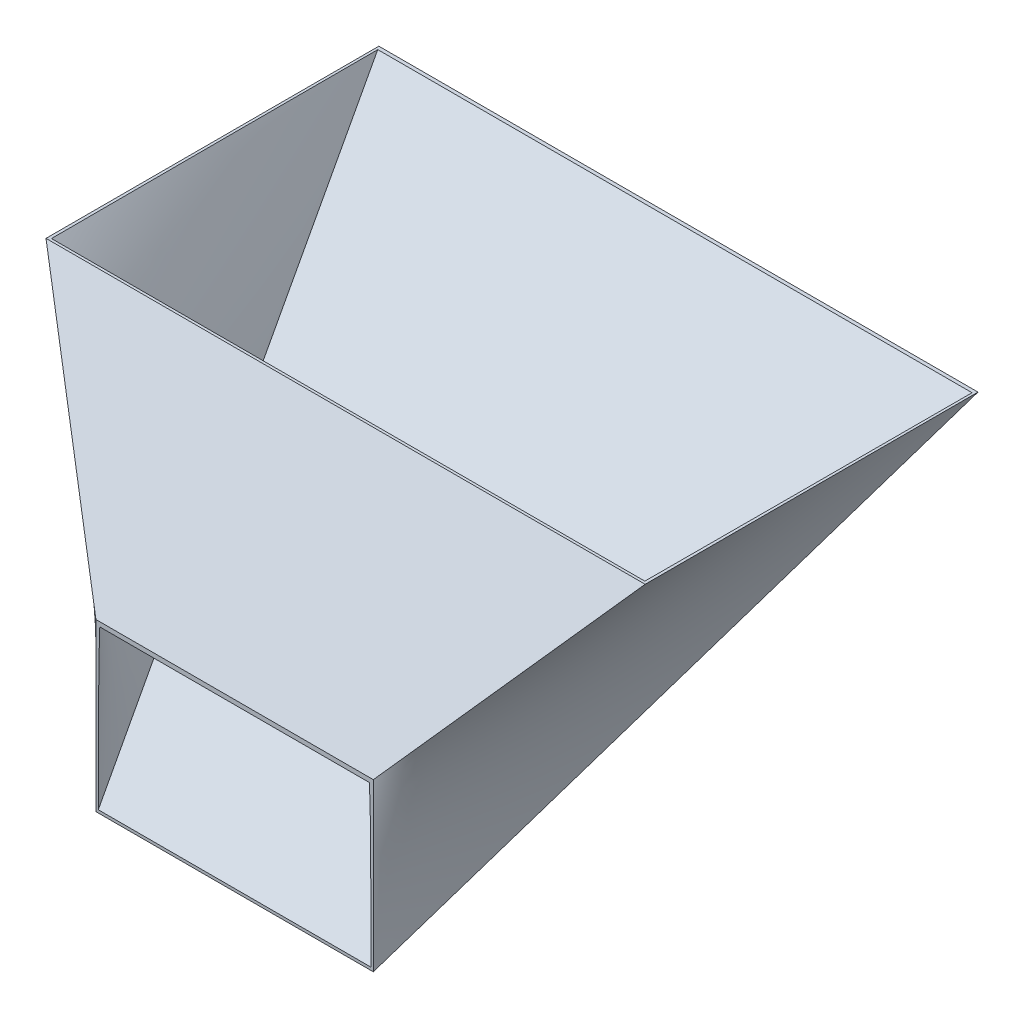
ISO-10303-21;
HEADER;
FILE_DESCRIPTION(('STEP AP214'),'2;1');
FILE_NAME('part.step','',(''),(''),'','','');
FILE_SCHEMA(('AUTOMOTIVE_DESIGN { 1 0 10303 214 1 1 1 1 }'));
ENDSEC;
DATA;
#1=APPLICATION_CONTEXT('core data for automotive mechanical design processes');
#2=APPLICATION_PROTOCOL_DEFINITION('international standard','automotive_design',2000,#1);
#3=PRODUCT_CONTEXT('',#1,'mechanical');
#4=PRODUCT('Part','Part','',(#3));
#5=PRODUCT_RELATED_PRODUCT_CATEGORY('part','',(#4));
#6=PRODUCT_DEFINITION_FORMATION('','',#4);
#7=PRODUCT_DEFINITION_CONTEXT('part definition',#1,'design');
#8=PRODUCT_DEFINITION('design','',#6,#7);
#9=PRODUCT_DEFINITION_SHAPE('','',#8);
#10=(LENGTH_UNIT() NAMED_UNIT(*) SI_UNIT(.MILLI.,.METRE.));
#11=(NAMED_UNIT(*) PLANE_ANGLE_UNIT() SI_UNIT($,.RADIAN.));
#12=(NAMED_UNIT(*) SI_UNIT($,.STERADIAN.) SOLID_ANGLE_UNIT());
#13=UNCERTAINTY_MEASURE_WITH_UNIT(LENGTH_MEASURE(1.E-05),#10,'distance_accuracy_value','');
#14=(GEOMETRIC_REPRESENTATION_CONTEXT(3) GLOBAL_UNCERTAINTY_ASSIGNED_CONTEXT((#13)) GLOBAL_UNIT_ASSIGNED_CONTEXT((#10,
#11,#12)) REPRESENTATION_CONTEXT('',''));
#15=CARTESIAN_POINT('',(0.,0.,0.));
#16=DIRECTION('',(0.,0.,1.));
#17=DIRECTION('',(1.,0.,0.));
#18=AXIS2_PLACEMENT_3D('',#15,#16,#17);
#19=CARTESIAN_POINT('',(0.,0.,250.));
#20=DIRECTION('',(0.,0.,-1.));
#21=DIRECTION('',(-1.,0.,0.));
#22=AXIS2_PLACEMENT_3D('',#19,#20,#21);
#23=PLANE('',#22);
#24=DIRECTION('',(0.,1.,0.));
#25=VECTOR('',#24,1.);
#26=CARTESIAN_POINT('',(125.,-324.999999999997,250.));
#27=LINE('',#26,#25);
#28=CARTESIAN_POINT('',(125.,-324.999999999997,250.));
#29=VERTEX_POINT('',#28);
#30=CARTESIAN_POINT('',(125.,-174.999999999997,250.));
#31=VERTEX_POINT('',#30);
#32=EDGE_CURVE('E306',#29,#31,#27,.T.);
#33=ORIENTED_EDGE('',*,*,#32,.T.);
#34=DIRECTION('',(-1.,0.,0.));
#35=VECTOR('',#34,1.);
#36=CARTESIAN_POINT('',(-125.,-174.999999999997,250.));
#37=LINE('',#36,#35);
#38=CARTESIAN_POINT('',(-125.,-174.999999999997,250.));
#39=VERTEX_POINT('',#38);
#40=EDGE_CURVE('E300',#31,#39,#37,.T.);
#41=ORIENTED_EDGE('',*,*,#40,.T.);
#42=DIRECTION('',(0.,-1.,0.));
#43=VECTOR('',#42,1.);
#44=CARTESIAN_POINT('',(-125.,-324.999999999997,250.));
#45=LINE('',#44,#43);
#46=CARTESIAN_POINT('',(-125.,-324.999999999997,250.));
#47=VERTEX_POINT('',#46);
#48=EDGE_CURVE('E63',#39,#47,#45,.T.);
#49=ORIENTED_EDGE('',*,*,#48,.T.);
#50=DIRECTION('',(1.,0.,0.));
#51=VECTOR('',#50,1.);
#52=CARTESIAN_POINT('',(-125.,-324.999999999997,250.));
#53=LINE('',#52,#51);
#54=EDGE_CURVE('E12',#47,#29,#53,.T.);
#55=ORIENTED_EDGE('',*,*,#54,.T.);
#56=EDGE_LOOP('',(#33,#41,#49,#55));
#57=FACE_BOUND('',#56,.T.);
#58=CARTESIAN_POINT('',(122.868674541676,-322.423058983986,250.));
#59=CARTESIAN_POINT('',(122.866143330679,-320.473384500141,250.));
#60=CARTESIAN_POINT('',(122.863504568685,-318.523710151907,250.));
#61=CARTESIAN_POINT('',(122.857981894483,-314.624362743429,250.));
#62=CARTESIAN_POINT('',(122.855097982392,-312.674689683185,250.));
#63=CARTESIAN_POINT('',(122.849054958397,-308.775344638326,250.));
#64=CARTESIAN_POINT('',(122.845895846584,-306.825672653711,250.));
#65=CARTESIAN_POINT('',(122.839266217613,-302.926329559881,250.));
#66=CARTESIAN_POINT('',(122.83579570051,-300.976658450665,250.));
#67=CARTESIAN_POINT('',(122.82850118742,-297.077241311729,250.));
#68=CARTESIAN_POINT('',(122.824677177736,-295.127495282036,250.));
#69=CARTESIAN_POINT('',(122.816626462662,-291.228003719825,250.));
#70=CARTESIAN_POINT('',(122.812399757205,-289.278258187309,250.));
#71=CARTESIAN_POINT('',(122.803485576671,-285.37876745825,250.));
#72=CARTESIAN_POINT('',(122.798798101427,-283.429022261707,250.));
#73=CARTESIAN_POINT('',(122.788893136781,-279.529532075106,250.));
#74=CARTESIAN_POINT('',(122.783675647071,-277.579787085049,250.));
#75=CARTESIAN_POINT('',(122.770550979941,-272.946611050203,250.));
#76=CARTESIAN_POINT('',(122.76237047779,-270.263180768469,250.));
#77=CARTESIAN_POINT('',(122.744586073072,-264.896326596243,250.));
#78=CARTESIAN_POINT('',(122.734982171419,-262.212902705748,250.));
#79=CARTESIAN_POINT('',(122.714003218894,-256.846067659846,250.));
#80=CARTESIAN_POINT('',(122.702628171914,-254.162656504423,250.));
#81=CARTESIAN_POINT('',(122.677647966573,-248.795930601566,250.));
#82=CARTESIAN_POINT('',(122.664042879848,-246.112615853804,250.));
#83=CARTESIAN_POINT('',(122.633983044675,-240.745996430513,250.));
#84=CARTESIAN_POINT('',(122.617528290199,-238.062691755018,250.));
#85=CARTESIAN_POINT('',(122.580924370803,-232.696084485779,250.));
#86=CARTESIAN_POINT('',(122.560775174879,-230.012781892242,250.));
#87=CARTESIAN_POINT('',(122.521227717359,-225.316680480988,250.));
#88=CARTESIAN_POINT('',(122.502899804522,-223.303872721079,250.));
#89=CARTESIAN_POINT('',(122.462792360055,-219.278294377936,250.));
#90=CARTESIAN_POINT('',(122.441012834045,-217.265523794649,250.));
#91=CARTESIAN_POINT('',(122.393080681927,-213.240056815171,250.));
#92=CARTESIAN_POINT('',(122.3669281054,-211.227360418397,250.));
#93=CARTESIAN_POINT('',(122.308992783193,-207.202082010851,250.));
#94=CARTESIAN_POINT('',(122.277210135196,-205.189499998699,250.));
#95=CARTESIAN_POINT('',(122.206250976566,-201.164289644527,250.));
#96=CARTESIAN_POINT('',(122.16707382377,-199.151661313674,250.));
#97=CARTESIAN_POINT('',(122.078826470773,-195.126610937964,250.));
#98=CARTESIAN_POINT('',(122.029756256157,-193.114188893412,250.));
#99=CARTESIAN_POINT('',(121.945872177249,-190.095807057274,250.));
#100=CARTESIAN_POINT('',(121.916197099938,-189.089704558605,250.));
#101=CARTESIAN_POINT('',(121.852745391581,-187.077631295368,250.));
#102=CARTESIAN_POINT('',(121.818968774178,-186.071660530373,250.));
#103=CARTESIAN_POINT('',(121.746494127192,-184.059782897983,250.));
#104=CARTESIAN_POINT('',(121.707795555042,-183.053876049884,250.));
#105=CARTESIAN_POINT('',(121.645259366511,-181.545196386351,250.));
#106=CARTESIAN_POINT('',(121.623665775856,-181.0423303259,250.));
#107=CARTESIAN_POINT('',(121.578813405592,-180.036671376156,250.));
#108=CARTESIAN_POINT('',(121.555554622049,-179.533878487038,250.));
#109=CARTESIAN_POINT('',(121.531378729892,-179.031128874147,250.));
#110=B_SPLINE_CURVE_WITH_KNOTS('',3,(#58,#59,#60,#61,#62,#63,#64,#65,#66,#67,#68,#69,#70,#71,
#72,#73,#74,#75,#76,#77,#78,#79,#80,#81,#82,#83,#84,#85,#86,#87,#88,#89,#90,#91,#92,#93,#94,#95,
#96,#97,#98,#99,#100,#101,#102,#103,#104,#105,#106,#107,#108,#109),.UNSPECIFIED.,.F.,.F.,(4,2,2,
2,2,2,2,2,2,2,2,2,2,2,2,2,2,2,2,2,2,2,2,2,2,4),(0.,5.84902838384323,11.6980539472343,
17.5470775571024,23.3961001233571,29.2453494258902,35.0945997209992,40.9438521497391,
46.7931079902373,54.843435931775,62.8937586995715,70.9440637772881,78.9941103060722,
87.0441738637353,95.0943049778076,101.132976324388,107.171637837388,113.210230889633,
119.248719181306,125.287732117472,131.326753853175,134.346367330382,137.365970762498,
140.385907346181,141.895893301783,143.405882823402),.UNSPECIFIED.);
#111=CARTESIAN_POINT('',(122.868674541676,-322.423058983986,250.));
#112=VERTEX_POINT('',#111);
#113=CARTESIAN_POINT('',(121.531378729892,-179.031128874147,250.));
#114=VERTEX_POINT('',#113);
#115=EDGE_CURVE('E135',#112,#114,#110,.T.);
#116=ORIENTED_EDGE('',*,*,#115,.F.);
#117=DIRECTION('',(1.,0.,0.));
#118=VECTOR('',#117,1.);
#119=CARTESIAN_POINT('',(0.,-322.423058983986,250.));
#120=LINE('',#119,#118);
#121=CARTESIAN_POINT('',(-122.868674541676,-322.423058983986,250.));
#122=VERTEX_POINT('',#121);
#123=EDGE_CURVE('E120',#122,#112,#120,.T.);
#124=ORIENTED_EDGE('',*,*,#123,.F.);
#125=CARTESIAN_POINT('',(-121.531378729892,-179.031128874147,250.));
#126=CARTESIAN_POINT('',(-121.573296981143,-179.903434216051,250.));
#127=CARTESIAN_POINT('',(-121.612501889865,-180.77586522597,250.));
#128=CARTESIAN_POINT('',(-121.686253142251,-182.520917371579,250.));
#129=CARTESIAN_POINT('',(-121.720799525592,-183.393538505588,250.));
#130=CARTESIAN_POINT('',(-121.785999415895,-185.138841053966,250.));
#131=CARTESIAN_POINT('',(-121.816653295003,-186.011522454581,250.));
#132=CARTESIAN_POINT('',(-121.87464081157,-187.75699705091,250.));
#133=CARTESIAN_POINT('',(-121.901974440875,-188.629790246892,250.));
#134=CARTESIAN_POINT('',(-121.979731175959,-191.248240739417,250.));
#135=CARTESIAN_POINT('',(-122.025912125301,-192.99402411481,250.));
#136=CARTESIAN_POINT('',(-122.109821008608,-196.485784712325,250.));
#137=CARTESIAN_POINT('',(-122.147548959431,-198.231761934053,250.));
#138=CARTESIAN_POINT('',(-122.216508186812,-201.723689512166,250.));
#139=CARTESIAN_POINT('',(-122.247740034698,-203.469639857398,250.));
#140=CARTESIAN_POINT('',(-122.305133249028,-206.961650100953,250.));
#141=CARTESIAN_POINT('',(-122.331294535519,-208.707710000569,250.));
#142=CARTESIAN_POINT('',(-122.379591913694,-212.199903194429,250.));
#143=CARTESIAN_POINT('',(-122.401727963046,-213.946036489252,250.));
#144=CARTESIAN_POINT('',(-122.44276031509,-217.438343290901,250.));
#145=CARTESIAN_POINT('',(-122.461656612947,-219.184516797783,250.));
#146=CARTESIAN_POINT('',(-122.502669183496,-223.258175245671,250.));
#147=CARTESIAN_POINT('',(-122.523763362137,-225.585670412053,250.));
#148=CARTESIAN_POINT('',(-122.562346041071,-230.240671791627,250.));
#149=CARTESIAN_POINT('',(-122.579834569604,-232.56817800459,250.));
#150=CARTESIAN_POINT('',(-122.611978698483,-237.223205170678,250.));
#151=CARTESIAN_POINT('',(-122.626634304421,-239.550726123766,250.));
#152=CARTESIAN_POINT('',(-122.653691420712,-244.2058706158,250.));
#153=CARTESIAN_POINT('',(-122.666092844219,-246.533494155244,250.));
#154=CARTESIAN_POINT('',(-122.689078438407,-251.188754836444,250.));
#155=CARTESIAN_POINT('',(-122.699662605399,-253.516391978218,250.));
#156=CARTESIAN_POINT('',(-122.719350223897,-258.17167409031,250.));
#157=CARTESIAN_POINT('',(-122.728453674367,-260.499319060632,250.));
#158=CARTESIAN_POINT('',(-122.746010344349,-265.310208572513,250.));
#159=CARTESIAN_POINT('',(-122.754379419768,-267.793453418634,250.));
#160=CARTESIAN_POINT('',(-122.769980894364,-272.75994512751,250.));
#161=CARTESIAN_POINT('',(-122.777213294236,-275.243191990264,250.));
#162=CARTESIAN_POINT('',(-122.79073706366,-280.209687443937,250.));
#163=CARTESIAN_POINT('',(-122.797028433519,-282.692936034855,250.));
#164=CARTESIAN_POINT('',(-122.80882569606,-287.659434754307,250.));
#165=CARTESIAN_POINT('',(-122.81433158884,-290.14268488284,250.));
#166=CARTESIAN_POINT('',(-122.824682398559,-295.109026656736,250.));
#167=CARTESIAN_POINT('',(-122.829527358022,-297.592118302011,250.));
#168=CARTESIAN_POINT('',(-122.838657584958,-302.558302964646,250.));
#169=CARTESIAN_POINT('',(-122.842942852352,-305.041395982007,250.));
#170=CARTESIAN_POINT('',(-122.851036863227,-310.007583323164,250.));
#171=CARTESIAN_POINT('',(-122.854845606605,-312.490677646961,250.));
#172=CARTESIAN_POINT('',(-122.86205201845,-317.456867570826,250.));
#173=CARTESIAN_POINT('',(-122.865449686805,-319.939963170895,250.));
#174=CARTESIAN_POINT('',(-122.868674541676,-322.423058983986,250.));
#175=B_SPLINE_CURVE_WITH_KNOTS('',3,(#125,#126,#127,#128,#129,#130,#131,#132,#133,#134,#135,
#136,#137,#138,#139,#140,#141,#142,#143,#144,#145,#146,#147,#148,#149,#150,#151,#152,#153,#154,
#155,#156,#157,#158,#159,#160,#161,#162,#163,#164,#165,#166,#167,#168,#169,#170,#171,#172,#173,
#174),.UNSPECIFIED.,.F.,.F.,(4,2,2,2,2,2,2,2,2,2,2,2,2,2,2,2,2,2,2,2,2,2,2,2,4),(0.,
2.61992477017324,5.23982722457925,7.85947901328451,10.4791372363422,15.7182880548783,
20.9574284248821,26.1961078206452,31.4348698129029,36.6736868960553,41.9125117987273,
48.895280177567,55.8779938649206,62.8606937711192,69.8436626402437,76.8266456847483,
83.8096336214376,91.2594101480772,98.7091821216266,106.158951655635,113.608720249456,
121.058009291753,128.507299382896,135.956591081587,143.405884814148),.UNSPECIFIED.);
#176=CARTESIAN_POINT('',(-121.531378729892,-179.031128874147,250.));
#177=VERTEX_POINT('',#176);
#178=EDGE_CURVE('E71',#177,#122,#175,.T.);
#179=ORIENTED_EDGE('',*,*,#178,.F.);
#180=DIRECTION('',(-1.,0.,0.));
#181=VECTOR('',#180,1.);
#182=CARTESIAN_POINT('',(0.,-179.031128874147,250.));
#183=LINE('',#182,#181);
#184=EDGE_CURVE('E143',#114,#177,#183,.T.);
#185=ORIENTED_EDGE('',*,*,#184,.F.);
#186=EDGE_LOOP('',(#116,#124,#179,#185));
#187=FACE_BOUND('',#186,.T.);
#188=ADVANCED_FACE('F52',(#57,#187),#23,.F.);
#189=CARTESIAN_POINT('',(0.,0.,0.));
#190=DIRECTION('',(0.,1.,0.));
#191=DIRECTION('',(0.,0.,1.));
#192=AXIS2_PLACEMENT_3D('',#189,#190,#191);
#193=PLANE('',#192);
#194=CARTESIAN_POINT('',(267.411756298249,0.,147.6964977862));
#195=CARTESIAN_POINT('',(267.434846643851,0.,139.897678665111));
#196=CARTESIAN_POINT('',(267.455997240212,0.,132.098854111054));
#197=CARTESIAN_POINT('',(267.495069056527,0.,116.501197321534));
#198=CARTESIAN_POINT('',(267.512990276668,0.,108.702365086071));
#199=CARTESIAN_POINT('',(267.546253461857,0.,93.1046967574923));
#200=CARTESIAN_POINT('',(267.561595427415,0.,85.3058606643783));
#201=CARTESIAN_POINT('',(267.5901560998,0.,69.7081844888893));
#202=CARTESIAN_POINT('',(267.603374806591,0.,61.9093444065143));
#203=CARTESIAN_POINT('',(267.642244846355,0.,37.3656118595995));
#204=CARTESIAN_POINT('',(267.664763965879,0.,20.6207144494947));
#205=CARTESIAN_POINT('',(267.704377602569,0.,-12.8690880773973));
#206=CARTESIAN_POINT('',(267.721472119209,0.,-29.6139931941851));
#207=CARTESIAN_POINT('',(267.75182535049,0.,-63.1038122885929));
#208=CARTESIAN_POINT('',(267.765084063886,0.,-79.848726266214));
#209=CARTESIAN_POINT('',(267.782886903814,0.,-104.966097303276));
#210=CARTESIAN_POINT('',(267.788473645064,0.,-113.338553655207));
#211=CARTESIAN_POINT('',(267.799043882002,0.,-130.083466718732));
#212=CARTESIAN_POINT('',(267.804027377693,0.,-138.455923430327));
#213=CARTESIAN_POINT('',(267.808755165928,0.,-146.828380287986));
#214=B_SPLINE_CURVE_WITH_KNOTS('',3,(#194,#195,#196,#197,#198,#199,#200,#201,#202,#203,#204,
#205,#206,#207,#208,#209,#210,#211,#212,#213),.UNSPECIFIED.,.F.,.F.,(4,2,2,2,2,2,2,2,2,4),(0.,
23.3965592214488,46.7931170839489,70.1896703108726,93.5862239371966,143.820960065196,
194.055701082652,244.290458415865,269.407833049301,294.525207616022),.UNSPECIFIED.);
#215=CARTESIAN_POINT('',(267.411756298249,0.,147.6964977862));
#216=VERTEX_POINT('',#215);
#217=CARTESIAN_POINT('',(267.808755165927,0.,-146.828380287986));
#218=VERTEX_POINT('',#217);
#219=EDGE_CURVE('E138',#216,#218,#214,.T.);
#220=ORIENTED_EDGE('',*,*,#219,.F.);
#221=DIRECTION('',(1.,0.,0.));
#222=VECTOR('',#221,1.);
#223=CARTESIAN_POINT('',(0.,0.,147.6964977862));
#224=LINE('',#223,#222);
#225=CARTESIAN_POINT('',(-267.411756298249,0.,147.6964977862));
#226=VERTEX_POINT('',#225);
#227=EDGE_CURVE('E505',#226,#216,#224,.T.);
#228=ORIENTED_EDGE('',*,*,#227,.F.);
#229=CARTESIAN_POINT('',(-267.808755165928,0.,-146.828380287986));
#230=CARTESIAN_POINT('',(-267.804134333256,0.,-138.647128529101));
#231=CARTESIAN_POINT('',(-267.799270860808,0.,-130.465876900697));
#232=CARTESIAN_POINT('',(-267.788969943614,0.,-114.103374012104));
#233=CARTESIAN_POINT('',(-267.783532498869,0.,-105.922122751915));
#234=CARTESIAN_POINT('',(-267.771994944348,0.,-89.5596207203461));
#235=CARTESIAN_POINT('',(-267.765894834573,0.,-81.3783699489672));
#236=CARTESIAN_POINT('',(-267.752920109484,0.,-65.0158713512887));
#237=CARTESIAN_POINT('',(-267.74604549439,0.,-56.8346235249889));
#238=CARTESIAN_POINT('',(-267.731387054738,0.,-40.4721286503038));
#239=CARTESIAN_POINT('',(-267.723603230176,0.,-32.2908816019185));
#240=CARTESIAN_POINT('',(-267.706960944255,0.,-15.9283884652603));
#241=CARTESIAN_POINT('',(-267.698102482879,0.,-7.74714237698742));
#242=CARTESIAN_POINT('',(-267.679106682879,0.,8.61535597827031));
#243=CARTESIAN_POINT('',(-267.668969343059,0.,16.7966082452538));
#244=CARTESIAN_POINT('',(-267.647160753254,0.,33.1591106511167));
#245=CARTESIAN_POINT('',(-267.635489503289,0.,41.3403607899961));
#246=CARTESIAN_POINT('',(-267.610293072754,0.,57.7028579529489));
#247=CARTESIAN_POINT('',(-267.596767892252,0.,65.8841049770224));
#248=CARTESIAN_POINT('',(-267.567451362068,0.,82.2465972368751));
#249=CARTESIAN_POINT('',(-267.551660011764,0.,90.4278424726534));
#250=CARTESIAN_POINT('',(-267.517296777922,0.,106.790327473792));
#251=CARTESIAN_POINT('',(-267.498724894297,0.,114.971567239153));
#252=CARTESIAN_POINT('',(-267.458063294715,0.,131.334039242769));
#253=CARTESIAN_POINT('',(-267.435973578213,0.,139.515271481024));
#254=CARTESIAN_POINT('',(-267.411756298249,0.,147.6964977862));
#255=B_SPLINE_CURVE_WITH_KNOTS('',3,(#229,#230,#231,#232,#233,#234,#235,#236,#237,#238,#239,
#240,#241,#242,#243,#244,#245,#246,#247,#248,#249,#250,#251,#252,#253,#254),.UNSPECIFIED.,.F.,
.F.,(4,2,2,2,2,2,2,2,2,2,2,2,4),(0.,24.5437591976562,49.087518377804,73.6312774828969,
98.1750295842545,122.718781778726,147.26253434819,171.806309871532,196.350085093989,
220.893859443495,245.437640523055,269.981422361879,294.525208003884),.UNSPECIFIED.);
#256=CARTESIAN_POINT('',(-267.808755165928,0.,-146.828380287986));
#257=VERTEX_POINT('',#256);
#258=EDGE_CURVE('E507',#257,#226,#255,.T.);
#259=ORIENTED_EDGE('',*,*,#258,.F.);
#260=DIRECTION('',(-1.,0.,0.));
#261=VECTOR('',#260,1.);
#262=CARTESIAN_POINT('',(0.,0.,-146.828380287986));
#263=LINE('',#262,#261);
#264=EDGE_CURVE('E141',#218,#257,#263,.T.);
#265=ORIENTED_EDGE('',*,*,#264,.F.);
#266=EDGE_LOOP('',(#220,#228,#259,#265));
#267=FACE_BOUND('',#266,.T.);
#268=DIRECTION('',(0.,0.,-1.));
#269=VECTOR('',#268,1.);
#270=CARTESIAN_POINT('',(270.,0.,-150.));
#271=LINE('',#270,#269);
#272=CARTESIAN_POINT('',(270.,0.,150.));
#273=VERTEX_POINT('',#272);
#274=CARTESIAN_POINT('',(270.,0.,-150.));
#275=VERTEX_POINT('',#274);
#276=EDGE_CURVE('E129',#273,#275,#271,.T.);
#277=ORIENTED_EDGE('',*,*,#276,.T.);
#278=DIRECTION('',(-1.,0.,0.));
#279=VECTOR('',#278,1.);
#280=CARTESIAN_POINT('',(-270.,0.,-150.));
#281=LINE('',#280,#279);
#282=CARTESIAN_POINT('',(-270.,0.,-150.));
#283=VERTEX_POINT('',#282);
#284=EDGE_CURVE('E220',#275,#283,#281,.T.);
#285=ORIENTED_EDGE('',*,*,#284,.T.);
#286=DIRECTION('',(0.,0.,1.));
#287=VECTOR('',#286,1.);
#288=CARTESIAN_POINT('',(-270.,0.,-150.));
#289=LINE('',#288,#287);
#290=CARTESIAN_POINT('',(-270.,0.,150.));
#291=VERTEX_POINT('',#290);
#292=EDGE_CURVE('E225',#283,#291,#289,.T.);
#293=ORIENTED_EDGE('',*,*,#292,.T.);
#294=DIRECTION('',(1.,0.,0.));
#295=VECTOR('',#294,1.);
#296=CARTESIAN_POINT('',(-270.,0.,150.));
#297=LINE('',#296,#295);
#298=EDGE_CURVE('E260',#291,#273,#297,.T.);
#299=ORIENTED_EDGE('',*,*,#298,.T.);
#300=EDGE_LOOP('',(#277,#285,#293,#299));
#301=FACE_BOUND('',#300,.T.);
#302=ADVANCED_FACE('F237',(#267,#301),#193,.T.);
#303=CARTESIAN_POINT('',(0.,-73.4117647058822,-59.6470588235288));
#304=DIRECTION('',(0.,0.776114000116268,0.630592625094463));
#305=DIRECTION('',(0.,-0.630592625094463,0.776114000116268));
#306=AXIS2_PLACEMENT_3D('',#303,#304,#305);
#307=PLANE('',#306);
#308=DIRECTION('',(-0.270827043762255,-0.607026132570567,0.747109086240703));
#309=VECTOR('',#308,1.);
#310=CARTESIAN_POINT('',(270.,0.,-150.));
#311=LINE('',#310,#309);
#312=EDGE_CURVE('E224',#275,#29,#311,.T.);
#313=ORIENTED_EDGE('',*,*,#312,.T.);
#314=ORIENTED_EDGE('',*,*,#54,.F.);
#315=DIRECTION('',(0.270827043762255,-0.607026132570567,0.747109086240703));
#316=VECTOR('',#315,1.);
#317=CARTESIAN_POINT('',(-270.,0.,-150.));
#318=LINE('',#317,#316);
#319=EDGE_CURVE('E333',#283,#47,#318,.T.);
#320=ORIENTED_EDGE('',*,*,#319,.F.);
#321=ORIENTED_EDGE('',*,*,#284,.F.);
#322=EDGE_LOOP('',(#313,#314,#320,#321));
#323=FACE_BOUND('',#322,.T.);
#324=ADVANCED_FACE('F194',(#323),#307,.F.);
#325=CARTESIAN_POINT('',(-270.,0.,150.));
#326=CARTESIAN_POINT('',(-125.,-174.999999999997,250.));
#327=CARTESIAN_POINT('',(-121.757731267312,-178.913082953242,252.236047401854));
#328=CARTESIAN_POINT('',(-270.,0.,100.));
#329=CARTESIAN_POINT('',(-125.,-199.999999999998,250.));
#330=CARTESIAN_POINT('',(-121.757731267312,-204.472094803705,253.354071102781));
#331=CARTESIAN_POINT('',(-270.,0.,50.));
#332=CARTESIAN_POINT('',(-125.,-224.999999999998,250.));
#333=CARTESIAN_POINT('',(-121.757731267312,-230.031106654169,254.472094803708));
#334=CARTESIAN_POINT('',(-270.,0.,-50.));
#335=CARTESIAN_POINT('',(-125.,-274.999999999998,250.));
#336=CARTESIAN_POINT('',(-121.757731267312,-281.149130355096,256.708142205562));
#337=CARTESIAN_POINT('',(-270.,0.,-100.));
#338=CARTESIAN_POINT('',(-125.,-299.999999999998,250.));
#339=CARTESIAN_POINT('',(-121.757731267312,-306.708142205559,257.826165906489));
#340=CARTESIAN_POINT('',(-270.,0.,-150.));
#341=CARTESIAN_POINT('',(-125.,-324.999999999997,250.));
#342=CARTESIAN_POINT('',(-121.757731267312,-332.267154056022,258.944189607416));
#343=B_SPLINE_SURFACE_WITH_KNOTS('',3,1,((#325,#326,#327),(#328,#329,#330),(#331,#332,#333),
(#334,#335,#336),(#337,#338,#339),(#340,#341,#342)),.UNSPECIFIED.,.F.,.F.,.F.,(4,2,4),(2,1,2),
(0.,0.5,1.),(0.,1.,1.02236047401854),.UNSPECIFIED.);
#344=DIRECTION('',(0.583984690219175,-0.704809108885201,0.402748062220121));
#345=VECTOR('',#344,1.);
#346=CARTESIAN_POINT('',(-270.,0.,150.));
#347=LINE('',#346,#345);
#348=EDGE_CURVE('E317',#291,#39,#347,.T.);
#349=ORIENTED_EDGE('',*,*,#292,.F.);
#350=ORIENTED_EDGE('',*,*,#319,.T.);
#351=ORIENTED_EDGE('',*,*,#48,.F.);
#352=ORIENTED_EDGE('',*,*,#348,.F.);
#353=EDGE_LOOP('',(#349,#350,#351,#352));
#354=FACE_BOUND('',#353,.T.);
#355=ADVANCED_FACE('F188',(#354),#343,.T.);
#356=CARTESIAN_POINT('',(270.,0.,-150.));
#357=CARTESIAN_POINT('',(125.,-324.999999999997,250.));
#358=CARTESIAN_POINT('',(121.757731267312,-332.267154056023,258.944189607416));
#359=CARTESIAN_POINT('',(270.,0.,-100.));
#360=CARTESIAN_POINT('',(125.,-299.999999999997,250.));
#361=CARTESIAN_POINT('',(121.757731267312,-306.708142205559,257.826165906489));
#362=CARTESIAN_POINT('',(270.,0.,-50.));
#363=CARTESIAN_POINT('',(125.,-274.999999999997,250.));
#364=CARTESIAN_POINT('',(121.757731267312,-281.149130355096,256.708142205562));
#365=CARTESIAN_POINT('',(270.,0.,50.));
#366=CARTESIAN_POINT('',(125.,-224.999999999997,250.));
#367=CARTESIAN_POINT('',(121.757731267312,-230.031106654169,254.472094803708));
#368=CARTESIAN_POINT('',(270.,0.,100.));
#369=CARTESIAN_POINT('',(125.,-199.999999999997,250.));
#370=CARTESIAN_POINT('',(121.757731267312,-204.472094803705,253.354071102781));
#371=CARTESIAN_POINT('',(270.,0.,150.));
#372=CARTESIAN_POINT('',(125.,-174.999999999997,250.));
#373=CARTESIAN_POINT('',(121.757731267312,-178.913082953242,252.236047401854));
#374=B_SPLINE_SURFACE_WITH_KNOTS('',3,1,((#356,#357,#358),(#359,#360,#361),(#362,#363,#364),
(#365,#366,#367),(#368,#369,#370),(#371,#372,#373)),.UNSPECIFIED.,.F.,.F.,.F.,(4,2,4),(2,1,2),
(0.,0.5,1.),(0.,1.,1.02236047401854),.UNSPECIFIED.);
#375=DIRECTION('',(-0.583984690219175,-0.704809108885201,0.402748062220121));
#376=VECTOR('',#375,1.);
#377=CARTESIAN_POINT('',(197.5,-87.4999999999987,200.));
#378=LINE('',#377,#376);
#379=EDGE_CURVE('E320',#273,#31,#378,.T.);
#380=ORIENTED_EDGE('',*,*,#276,.F.);
#381=ORIENTED_EDGE('',*,*,#379,.T.);
#382=ORIENTED_EDGE('',*,*,#32,.F.);
#383=ORIENTED_EDGE('',*,*,#312,.F.);
#384=EDGE_LOOP('',(#380,#381,#382,#383));
#385=FACE_BOUND('',#384,.T.);
#386=ADVANCED_FACE('F163',(#385),#374,.T.);
#387=CARTESIAN_POINT('',(0.,64.6153846153851,113.076923076922));
#388=DIRECTION('',(0.,-0.496138938356839,-0.868243142124456));
#389=DIRECTION('',(0.,0.868243142124456,-0.496138938356839));
#390=AXIS2_PLACEMENT_3D('',#387,#388,#389);
#391=PLANE('',#390);
#392=ORIENTED_EDGE('',*,*,#348,.T.);
#393=ORIENTED_EDGE('',*,*,#40,.F.);
#394=ORIENTED_EDGE('',*,*,#379,.F.);
#395=ORIENTED_EDGE('',*,*,#298,.F.);
#396=EDGE_LOOP('',(#392,#393,#394,#395));
#397=FACE_BOUND('',#396,.T.);
#398=ADVANCED_FACE('F372',(#397),#391,.F.);
#399=CARTESIAN_POINT('',(0.,-71.8595367056497,-58.3858735733399));
#400=DIRECTION('',(0.,0.776114000116268,0.630592625094463));
#401=DIRECTION('',(0.,-0.630592625094463,0.776114000116268));
#402=AXIS2_PLACEMENT_3D('',#399,#400,#401);
#403=PLANE('',#402);
#404=CARTESIAN_POINT('',(267.808755165928,0.,-146.828380287986));
#405=CARTESIAN_POINT('',(263.571347398776,-9.46587589693494,-135.178071491759));
#406=CARTESIAN_POINT('',(259.333266211474,-18.9316319363799,-123.527910212442));
#407=CARTESIAN_POINT('',(250.855497933724,-37.8628581118768,-100.227939534907));
#408=CARTESIAN_POINT('',(246.615810843264,-47.3283282479267,-88.5781301366915));
#409=CARTESIAN_POINT('',(238.134570482989,-66.2589391363842,-65.2789167355129));
#410=CARTESIAN_POINT('',(233.893017212615,-75.7240798886921,-53.6295127326723));
#411=CARTESIAN_POINT('',(225.4077082165,-94.6539687866082,-30.3311879352369));
#412=CARTESIAN_POINT('',(221.16395249076,-104.118716932217,-18.6822671406415));
#413=CARTESIAN_POINT('',(209.110777103645,-130.991799171256,14.3922956150997));
#414=CARTESIAN_POINT('',(201.298280300068,-148.399584597475,35.8172622935223));
#415=CARTESIAN_POINT('',(189.570432728743,-174.509635438357,67.9527094823011));
#416=CARTESIAN_POINT('',(185.6596334535,-183.212713814293,78.6641905603764));
#417=CARTESIAN_POINT('',(177.834408333223,-200.618222200206,100.086354727654));
#418=CARTESIAN_POINT('',(173.919982488217,-209.320652210187,110.797037816862));
#419=CARTESIAN_POINT('',(166.086801476041,-226.724750723658,132.217466756517));
#420=CARTESIAN_POINT('',(162.168046302772,-235.426419226055,142.927212605622));
#421=CARTESIAN_POINT('',(154.325342390134,-252.82882530181,164.345558545014));
#422=CARTESIAN_POINT('',(150.401393650915,-261.529562875196,175.054158635334));
#423=CARTESIAN_POINT('',(142.547227571711,-278.929916538882,196.469978529102));
#424=CARTESIAN_POINT('',(138.617010229407,-287.629532628768,207.177198332038));
#425=CARTESIAN_POINT('',(132.715974755933,-300.67793045785,223.236764890909));
#426=CARTESIAN_POINT('',(130.748011253715,-305.027225572911,228.589743494061));
#427=CARTESIAN_POINT('',(126.809975677922,-313.725436281031,239.295233596363));
#428=CARTESIAN_POINT('',(124.839903604305,-318.074351874083,244.647745095503));
#429=CARTESIAN_POINT('',(122.868674541676,-322.423058983986,250.));
#430=B_SPLINE_CURVE_WITH_KNOTS('',3,(#404,#405,#406,#407,#408,#409,#410,#411,#412,#413,#414,
#415,#416,#417,#418,#419,#420,#421,#422,#423,#424,#425,#426,#427,#428,#429),.UNSPECIFIED.,.F.,
.F.,(4,2,2,2,2,2,2,2,2,2,2,2,4),(0.,46.7930885583482,93.5861774343796,140.379280334019,
187.172383180343,273.241293080321,316.275741226203,359.310189047849,402.344697568403,
445.379204841362,488.413728033503,509.930991836245,531.44825606681),.UNSPECIFIED.);
#431=EDGE_CURVE('E123',#218,#112,#430,.T.);
#432=ORIENTED_EDGE('',*,*,#431,.F.);
#433=ORIENTED_EDGE('',*,*,#264,.T.);
#434=CARTESIAN_POINT('',(-267.808755165928,0.,-146.828380287986));
#435=CARTESIAN_POINT('',(-264.567406074514,-7.24080696013604,-137.916617875511));
#436=CARTESIAN_POINT('',(-261.325657821419,-14.4815428678149,-129.004942912214));
#437=CARTESIAN_POINT('',(-254.84125574495,-28.9628534554137,-111.181791419785));
#438=CARTESIAN_POINT('',(-251.598601921574,-36.2034281353332,-102.270314890653));
#439=CARTESIAN_POINT('',(-241.869120368646,-57.924883562462,-75.5362159034172));
#440=CARTESIAN_POINT('',(-235.380773433427,-72.4054937374843,-57.7139264572357));
#441=CARTESIAN_POINT('',(-222.398910404518,-101.365792895288,-22.0704813399389));
#442=CARTESIAN_POINT('',(-215.905394310788,-115.845481878062,-4.24932566883225));
#443=CARTESIAN_POINT('',(-206.160074094872,-137.564114220872,22.4812987530887));
#444=CARTESIAN_POINT('',(-202.910793169394,-144.803507792524,31.3913216105057));
#445=CARTESIAN_POINT('',(-196.410295852811,-159.281949553685,49.2109422396278));
#446=CARTESIAN_POINT('',(-193.159079461669,-166.520997743189,58.1205400113244));
#447=CARTESIAN_POINT('',(-186.195036854259,-182.021173756666,77.1976797202194));
#448=CARTESIAN_POINT('',(-182.481874422937,-190.282241516405,87.3651477322063));
#449=CARTESIAN_POINT('',(-175.052136378606,-206.80376662734,107.699332484126));
#450=CARTESIAN_POINT('',(-171.335560765631,-215.064223978541,117.866049224067));
#451=CARTESIAN_POINT('',(-163.898365797581,-231.584414391969,138.198591271363));
#452=CARTESIAN_POINT('',(-160.177746442711,-239.844147454232,148.364416578763));
#453=CARTESIAN_POINT('',(-152.731690568915,-256.362754340929,168.695009670082));
#454=CARTESIAN_POINT('',(-149.006254047742,-264.62162816496,178.859777453506));
#455=CARTESIAN_POINT('',(-141.549620997731,-281.138342337032,199.188041049902));
#456=CARTESIAN_POINT('',(-137.818424468627,-289.396182685025,209.351536862817));
#457=CARTESIAN_POINT('',(-132.216432059694,-301.782009377683,224.59563125378));
#458=CARTESIAN_POINT('',(-130.348234775515,-305.910463104775,229.67680507174));
#459=CARTESIAN_POINT('',(-126.609930875051,-314.167026870966,239.838729707052));
#460=CARTESIAN_POINT('',(-124.739824258734,-318.295136910058,244.919480524396));
#461=CARTESIAN_POINT('',(-122.868674541676,-322.423058983986,250.));
#462=B_SPLINE_CURVE_WITH_KNOTS('',3,(#434,#435,#436,#437,#438,#439,#440,#441,#442,#443,#444,
#445,#446,#447,#448,#449,#450,#451,#452,#453,#454,#455,#456,#457,#458,#459,#460,#461),
.UNSPECIFIED.,.F.,.F.,(4,2,2,2,2,2,2,2,2,2,2,2,2,4),(0.,35.7938018004609,71.5876036770221,
143.17521711686,214.762831101789,250.556634592867,286.350438791671,327.200065004369,
368.049690815979,408.899314579848,449.748957408394,490.598602112163,511.023429092913,
531.44825642692),.UNSPECIFIED.);
#463=EDGE_CURVE('E125',#257,#122,#462,.T.);
#464=ORIENTED_EDGE('',*,*,#463,.T.);
#465=ORIENTED_EDGE('',*,*,#123,.T.);
#466=EDGE_LOOP('',(#432,#433,#464,#465));
#467=FACE_BOUND('',#466,.T.);
#468=ADVANCED_FACE('F122',(#467),#403,.T.);
#469=CARTESIAN_POINT('',(-270.,0.,150.));
#470=CARTESIAN_POINT('',(-121.757731267312,-178.913082953242,252.236047401854));
#471=CARTESIAN_POINT('',(-270.,0.,100.));
#472=CARTESIAN_POINT('',(-121.757731267312,-204.472094803705,253.354071102781));
#473=CARTESIAN_POINT('',(-270.,0.,50.));
#474=CARTESIAN_POINT('',(-121.757731267312,-230.031106654169,254.472094803708));
#475=CARTESIAN_POINT('',(-270.,0.,-50.));
#476=CARTESIAN_POINT('',(-121.757731267312,-281.149130355096,256.708142205562));
#477=CARTESIAN_POINT('',(-270.,0.,-100.));
#478=CARTESIAN_POINT('',(-121.757731267312,-306.708142205559,257.826165906489));
#479=CARTESIAN_POINT('',(-270.,0.,-150.));
#480=CARTESIAN_POINT('',(-121.757731267312,-332.267154056022,258.944189607416));
#481=B_SPLINE_SURFACE_WITH_KNOTS('',3,1,((#469,#470),(#471,#472),(#473,#474),(#475,#476),(#477,
#478),(#479,#480)),.UNSPECIFIED.,.F.,.F.,.F.,(4,2,4),(2,2),(0.,0.5,1.),(0.,1.02236047401854),.UNSPECIFIED.);
#482=OFFSET_SURFACE('',#481,-2.,.F.);
#483=ORIENTED_EDGE('',*,*,#258,.T.);
#484=CARTESIAN_POINT('',(-267.411756298249,0.,147.6964977862));
#485=CARTESIAN_POINT('',(-263.947872356954,-4.21704466686294,150.106237595836));
#486=CARTESIAN_POINT('',(-260.484818399124,-8.43460338953009,152.516271151646));
#487=CARTESIAN_POINT('',(-253.560595234831,-16.870887476507,157.337004915633));
#488=CARTESIAN_POINT('',(-250.099426028518,-21.0896128409093,159.747705123863));
#489=CARTESIAN_POINT('',(-243.179196483243,-29.5283695577627,164.569851819208));
#490=CARTESIAN_POINT('',(-239.720136145024,-33.7484009106731,166.981298306585));
#491=CARTESIAN_POINT('',(-232.804384898233,-42.1899268149872,171.805027394765));
#492=CARTESIAN_POINT('',(-229.347693989589,-46.4114213663462,174.217309995541));
#493=CARTESIAN_POINT('',(-222.436962394944,-54.8560487404769,179.042811352188));
#494=CARTESIAN_POINT('',(-218.982921710294,-59.0791815640816,181.456030108533));
#495=CARTESIAN_POINT('',(-212.07779401434,-67.5272674979829,186.283507785048));
#496=CARTESIAN_POINT('',(-208.626707003156,-71.7522206083541,188.69776670526));
#497=CARTESIAN_POINT('',(-201.727792399973,-80.2041316512036,193.527430158317));
#498=CARTESIAN_POINT('',(-198.279964807519,-84.4310895834021,195.942834691002));
#499=CARTESIAN_POINT('',(-191.387847343436,-92.8871784891666,200.774885494296));
#500=CARTESIAN_POINT('',(-187.943557471427,-97.1163094624986,203.191531764772));
#501=CARTESIAN_POINT('',(-180.993670473411,-105.656793036091,208.071808092539));
#502=CARTESIAN_POINT('',(-177.488144607348,-109.968189351681,210.535463130019));
#503=CARTESIAN_POINT('',(-170.481001076014,-118.593376360745,215.464141420913));
#504=CARTESIAN_POINT('',(-166.979383411304,-122.907167054562,217.929164674522));
#505=CARTESIAN_POINT('',(-159.979759978075,-131.536958818373,222.860474253843));
#506=CARTESIAN_POINT('',(-156.481754210713,-135.852959889075,225.326760579959));
#507=CARTESIAN_POINT('',(-149.488550235125,-144.486683278635,230.260316802565));
#508=CARTESIAN_POINT('',(-145.993352030045,-148.804405599415,232.727586700153));
#509=CARTESIAN_POINT('',(-139.004309529991,-157.440674481413,237.662597489867));
#510=CARTESIAN_POINT('',(-135.510465234696,-161.759221042436,240.13033838188));
#511=CARTESIAN_POINT('',(-130.269153143122,-168.236705467521,243.831758053357));
#512=CARTESIAN_POINT('',(-128.521958885004,-170.395810157875,245.06553216213));
#513=CARTESIAN_POINT('',(-125.027096784,-174.713730636659,247.532915292864));
#514=CARTESIAN_POINT('',(-123.279428941103,-176.872546425083,248.766524314821));
#515=CARTESIAN_POINT('',(-121.531378729892,-179.031128874147,250.));
#516=B_SPLINE_CURVE_WITH_KNOTS('',3,(#484,#485,#486,#487,#488,#489,#490,#491,#492,#493,#494,
#495,#496,#497,#498,#499,#500,#501,#502,#503,#504,#505,#506,#507,#508,#509,#510,#511,#512,#513,
#514,#515),.UNSPECIFIED.,.F.,.F.,(4,2,2,2,2,2,2,2,2,2,2,2,2,2,2,4),(0.,17.8969057561212,
35.7938129322496,53.6907264093594,71.587639339685,89.4845613826268,107.381484158234,
125.278404436596,143.175322787894,161.410397330789,179.645474485548,197.880557475952,
216.115660874137,234.350759947267,243.468302034749,252.585844316779),.UNSPECIFIED.);
#517=EDGE_CURVE('E78',#226,#177,#516,.T.);
#518=ORIENTED_EDGE('',*,*,#517,.T.);
#519=ORIENTED_EDGE('',*,*,#178,.T.);
#520=ORIENTED_EDGE('',*,*,#463,.F.);
#521=EDGE_LOOP('',(#483,#518,#519,#520));
#522=FACE_BOUND('',#521,.T.);
#523=ADVANCED_FACE('F177',(#522),#482,.F.);
#524=CARTESIAN_POINT('',(270.,0.,-150.));
#525=CARTESIAN_POINT('',(121.757731267312,-332.267154056023,258.944189607416));
#526=CARTESIAN_POINT('',(270.,0.,-100.));
#527=CARTESIAN_POINT('',(121.757731267312,-306.708142205559,257.826165906489));
#528=CARTESIAN_POINT('',(270.,0.,-50.));
#529=CARTESIAN_POINT('',(121.757731267312,-281.149130355096,256.708142205562));
#530=CARTESIAN_POINT('',(270.,0.,50.));
#531=CARTESIAN_POINT('',(121.757731267312,-230.031106654169,254.472094803708));
#532=CARTESIAN_POINT('',(270.,0.,100.));
#533=CARTESIAN_POINT('',(121.757731267312,-204.472094803705,253.354071102781));
#534=CARTESIAN_POINT('',(270.,0.,150.));
#535=CARTESIAN_POINT('',(121.757731267312,-178.913082953242,252.236047401854));
#536=B_SPLINE_SURFACE_WITH_KNOTS('',3,1,((#524,#525),(#526,#527),(#528,#529),(#530,#531),(#532,
#533),(#534,#535)),.UNSPECIFIED.,.F.,.F.,.F.,(4,2,4),(2,2),(0.,0.5,1.),(0.,1.02236047401854),.UNSPECIFIED.);
#537=OFFSET_SURFACE('',#536,-2.,.F.);
#538=ORIENTED_EDGE('',*,*,#219,.T.);
#539=ORIENTED_EDGE('',*,*,#431,.T.);
#540=ORIENTED_EDGE('',*,*,#115,.T.);
#541=CARTESIAN_POINT('',(267.411756298249,0.,147.6964977862));
#542=CARTESIAN_POINT('',(264.392872366679,-3.67528464801135,149.796660442207));
#543=CARTESIAN_POINT('',(261.374620583386,-7.3509607970012,151.897046813058));
#544=CARTESIAN_POINT('',(255.339526785364,-14.7031865166865,156.098318652878));
#545=CARTESIAN_POINT('',(252.32268477091,-18.3797360875507,158.199204121944));
#546=CARTESIAN_POINT('',(246.290556956949,-25.7337978850487,162.401525149086));
#547=CARTESIAN_POINT('',(243.275271157542,-29.4113101117443,164.502960707197));
#548=CARTESIAN_POINT('',(237.246422057676,-36.767398157333,168.706439590391));
#549=CARTESIAN_POINT('',(234.232858757013,-40.4459739761011,170.808482915401));
#550=CARTESIAN_POINT('',(228.207634356531,-47.8042995221837,175.013240370306));
#551=CARTESIAN_POINT('',(225.195973256608,-51.4840492494342,177.115954500163));
#552=CARTESIAN_POINT('',(219.174746587554,-58.8448408138489,181.3221211084));
#553=CARTESIAN_POINT('',(216.165181018361,-62.5258826509742,183.425573586758));
#554=CARTESIAN_POINT('',(210.601179186703,-69.3351978167715,187.316610824356));
#555=CARTESIAN_POINT('',(208.046423192612,-72.463274196328,189.104083041246));
#556=CARTESIAN_POINT('',(202.938691945118,-78.7205228403057,192.679653694947));
#557=CARTESIAN_POINT('',(200.385716691739,-81.8496951047413,194.467752131767));
#558=CARTESIAN_POINT('',(195.281662434862,-88.1092053729482,198.044615142171));
#559=CARTESIAN_POINT('',(192.730583431406,-91.2395433767458,199.83337971577));
#560=CARTESIAN_POINT('',(187.630418739935,-97.5014433519312,203.411608273019));
#561=CARTESIAN_POINT('',(185.081333051951,-100.633005323338,205.20107225668));
#562=CARTESIAN_POINT('',(179.985217597964,-106.897390015836,208.780720652393));
#563=CARTESIAN_POINT('',(177.438187831931,-110.030212736907,210.570905064434));
#564=CARTESIAN_POINT('',(172.34618992706,-116.297120518846,214.151995225542));
#565=CARTESIAN_POINT('',(169.801221788032,-119.431205579596,215.942900974542));
#566=CARTESIAN_POINT('',(164.713246873661,-125.700610337724,219.525417979187));
#567=CARTESIAN_POINT('',(162.170240112977,-128.835930044071,221.317029239956));
#568=CARTESIAN_POINT('',(157.086002990934,-135.107655259294,224.900872220084));
#569=CARTESIAN_POINT('',(154.54477262968,-138.244060768236,226.693103939479));
#570=CARTESIAN_POINT('',(149.463725448614,-144.517735374475,230.27806085733));
#571=CARTESIAN_POINT('',(146.923908628993,-147.655004471889,232.070786055852));
#572=CARTESIAN_POINT('',(141.845140516348,-153.930070893592,235.656538296826));
#573=CARTESIAN_POINT('',(139.306189223364,-157.067868217906,237.449565339291));
#574=CARTESIAN_POINT('',(134.228423936025,-163.343546034192,241.035666948597));
#575=CARTESIAN_POINT('',(131.689609941652,-166.481426526154,242.828741515432));
#576=CARTESIAN_POINT('',(126.611255465095,-172.756742804801,246.414636531802));
#577=CARTESIAN_POINT('',(124.071714983139,-175.894178591625,248.207456981416));
#578=CARTESIAN_POINT('',(121.531378729892,-179.031128874147,250.));
#579=B_SPLINE_CURVE_WITH_KNOTS('',3,(#541,#542,#543,#544,#545,#546,#547,#548,#549,#550,#551,
#552,#553,#554,#555,#556,#557,#558,#559,#560,#561,#562,#563,#564,#565,#566,#567,#568,#569,#570,
#571,#572,#573,#574,#575,#576,#577,#578),.UNSPECIFIED.,.F.,.F.,(4,2,2,2,2,2,2,2,2,2,2,2,2,2,2,2,
2,2,4),(0.,15.597709662563,31.1954223423407,46.7931360237957,62.390847870964,77.9885588681893,
93.5862693979157,106.83618485292,120.086100482161,133.336016411097,146.585932546294,
159.835848480807,173.085763195154,186.335776002278,199.585789606554,212.835805020973,
226.085821053482,239.335835404798,252.585845603003),.UNSPECIFIED.);
#580=EDGE_CURVE('E149',#216,#114,#579,.T.);
#581=ORIENTED_EDGE('',*,*,#580,.F.);
#582=EDGE_LOOP('',(#538,#539,#540,#581));
#583=FACE_BOUND('',#582,.T.);
#584=ADVANCED_FACE('F133',(#583),#537,.F.);
#585=CARTESIAN_POINT('',(0.,63.6231067386714,111.340436792673));
#586=DIRECTION('',(0.,-0.496138938356839,-0.868243142124456));
#587=DIRECTION('',(0.,0.868243142124456,-0.496138938356839));
#588=AXIS2_PLACEMENT_3D('',#585,#586,#587);
#589=PLANE('',#588);
#590=ORIENTED_EDGE('',*,*,#517,.F.);
#591=ORIENTED_EDGE('',*,*,#227,.T.);
#592=ORIENTED_EDGE('',*,*,#580,.T.);
#593=ORIENTED_EDGE('',*,*,#184,.T.);
#594=EDGE_LOOP('',(#590,#591,#592,#593));
#595=FACE_BOUND('',#594,.T.);
#596=ADVANCED_FACE('F182',(#595),#589,.T.);
#597=CLOSED_SHELL('',(#188,#302,#324,#355,#386,#398,#468,#523,#584,#596));
#598=MANIFOLD_SOLID_BREP('B2',#597);
#599=ADVANCED_BREP_SHAPE_REPRESENTATION('',(#18,#598),#14);
#600=SHAPE_DEFINITION_REPRESENTATION(#9,#599);
ENDSEC;
END-ISO-10303-21;
